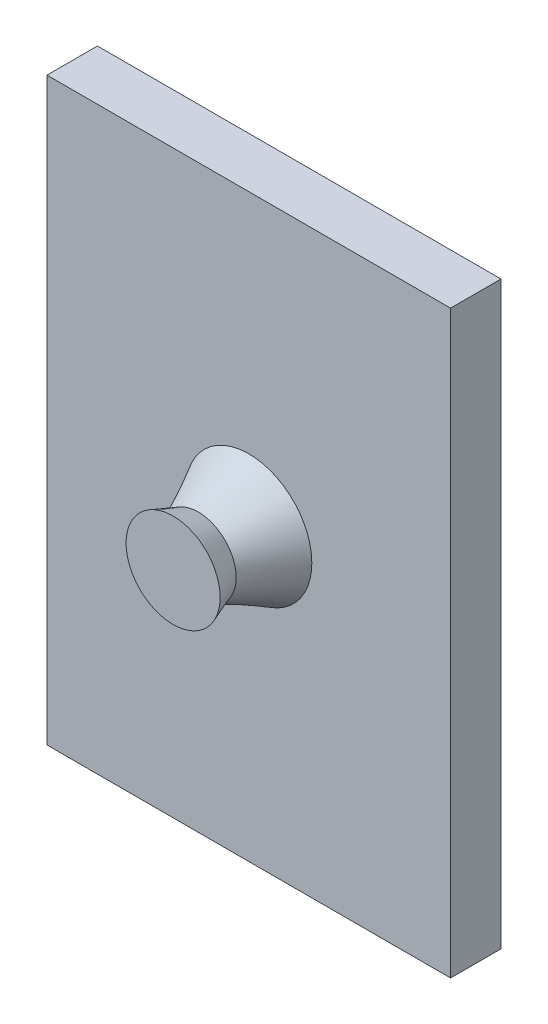
ISO-10303-21;
HEADER;
FILE_DESCRIPTION(('STEP AP214'),'2;1');
FILE_NAME('part.step','',(''),(''),'','','');
FILE_SCHEMA(('AUTOMOTIVE_DESIGN { 1 0 10303 214 1 1 1 1 }'));
ENDSEC;
DATA;
#1=APPLICATION_CONTEXT('core data for automotive mechanical design processes');
#2=APPLICATION_PROTOCOL_DEFINITION('international standard','automotive_design',2000,#1);
#3=PRODUCT_CONTEXT('',#1,'mechanical');
#4=PRODUCT('Part','Part','',(#3));
#5=PRODUCT_RELATED_PRODUCT_CATEGORY('part','',(#4));
#6=PRODUCT_DEFINITION_FORMATION('','',#4);
#7=PRODUCT_DEFINITION_CONTEXT('part definition',#1,'design');
#8=PRODUCT_DEFINITION('design','',#6,#7);
#9=PRODUCT_DEFINITION_SHAPE('','',#8);
#10=(LENGTH_UNIT() NAMED_UNIT(*) SI_UNIT(.MILLI.,.METRE.));
#11=(NAMED_UNIT(*) PLANE_ANGLE_UNIT() SI_UNIT($,.RADIAN.));
#12=(NAMED_UNIT(*) SI_UNIT($,.STERADIAN.) SOLID_ANGLE_UNIT());
#13=UNCERTAINTY_MEASURE_WITH_UNIT(LENGTH_MEASURE(1.E-05),#10,'distance_accuracy_value','');
#14=(GEOMETRIC_REPRESENTATION_CONTEXT(3) GLOBAL_UNCERTAINTY_ASSIGNED_CONTEXT((#13)) GLOBAL_UNIT_ASSIGNED_CONTEXT((#10,
#11,#12)) REPRESENTATION_CONTEXT('',''));
#15=CARTESIAN_POINT('',(0.,0.,0.));
#16=DIRECTION('',(0.,0.,1.));
#17=DIRECTION('',(1.,0.,0.));
#18=AXIS2_PLACEMENT_3D('',#15,#16,#17);
#19=CARTESIAN_POINT('',(0.,0.,2.));
#20=DIRECTION('',(1.,0.,0.));
#21=DIRECTION('',(0.,0.,-1.));
#22=AXIS2_PLACEMENT_3D('',#19,#20,#21);
#23=PLANE('',#22);
#24=DIRECTION('',(0.,-1.,0.));
#25=VECTOR('',#24,1.);
#26=CARTESIAN_POINT('',(0.,0.,0.));
#27=LINE('',#26,#25);
#28=CARTESIAN_POINT('',(0.,23.,0.));
#29=VERTEX_POINT('',#28);
#30=CARTESIAN_POINT('',(0.,0.,0.));
#31=VERTEX_POINT('',#30);
#32=EDGE_CURVE('E119',#29,#31,#27,.T.);
#33=ORIENTED_EDGE('',*,*,#32,.T.);
#34=DIRECTION('',(0.,0.,-1.));
#35=VECTOR('',#34,1.);
#36=CARTESIAN_POINT('',(0.,0.,2.));
#37=LINE('',#36,#35);
#38=CARTESIAN_POINT('',(0.,0.,2.));
#39=VERTEX_POINT('',#38);
#40=EDGE_CURVE('E12',#39,#31,#37,.T.);
#41=ORIENTED_EDGE('',*,*,#40,.F.);
#42=DIRECTION('',(0.,-1.,0.));
#43=VECTOR('',#42,1.);
#44=CARTESIAN_POINT('',(0.,0.,2.));
#45=LINE('',#44,#43);
#46=CARTESIAN_POINT('',(0.,23.,2.));
#47=VERTEX_POINT('',#46);
#48=EDGE_CURVE('E102',#47,#39,#45,.T.);
#49=ORIENTED_EDGE('',*,*,#48,.F.);
#50=DIRECTION('',(0.,0.,-1.));
#51=VECTOR('',#50,1.);
#52=CARTESIAN_POINT('',(0.,23.,2.));
#53=LINE('',#52,#51);
#54=EDGE_CURVE('E115',#47,#29,#53,.T.);
#55=ORIENTED_EDGE('',*,*,#54,.T.);
#56=EDGE_LOOP('',(#33,#41,#49,#55));
#57=FACE_BOUND('',#56,.T.);
#58=ADVANCED_FACE('F47',(#57),#23,.F.);
#59=CARTESIAN_POINT('',(0.,0.,2.));
#60=DIRECTION('',(0.,1.,0.));
#61=DIRECTION('',(0.,0.,1.));
#62=AXIS2_PLACEMENT_3D('',#59,#60,#61);
#63=PLANE('',#62);
#64=DIRECTION('',(1.,0.,0.));
#65=VECTOR('',#64,1.);
#66=CARTESIAN_POINT('',(0.,0.,0.));
#67=LINE('',#66,#65);
#68=CARTESIAN_POINT('',(16.,0.,0.));
#69=VERTEX_POINT('',#68);
#70=EDGE_CURVE('E107',#31,#69,#67,.T.);
#71=ORIENTED_EDGE('',*,*,#70,.T.);
#72=DIRECTION('',(0.,0.,-1.));
#73=VECTOR('',#72,1.);
#74=CARTESIAN_POINT('',(16.,0.,2.));
#75=LINE('',#74,#73);
#76=CARTESIAN_POINT('',(16.,0.,2.));
#77=VERTEX_POINT('',#76);
#78=EDGE_CURVE('E58',#77,#69,#75,.T.);
#79=ORIENTED_EDGE('',*,*,#78,.F.);
#80=DIRECTION('',(1.,0.,0.));
#81=VECTOR('',#80,1.);
#82=CARTESIAN_POINT('',(0.,0.,2.));
#83=LINE('',#82,#81);
#84=EDGE_CURVE('E97',#39,#77,#83,.T.);
#85=ORIENTED_EDGE('',*,*,#84,.F.);
#86=ORIENTED_EDGE('',*,*,#40,.T.);
#87=EDGE_LOOP('',(#71,#79,#85,#86));
#88=FACE_BOUND('',#87,.T.);
#89=ADVANCED_FACE('F106',(#88),#63,.F.);
#90=CARTESIAN_POINT('',(16.,0.,2.));
#91=DIRECTION('',(-1.,0.,0.));
#92=DIRECTION('',(0.,0.,1.));
#93=AXIS2_PLACEMENT_3D('',#90,#91,#92);
#94=PLANE('',#93);
#95=DIRECTION('',(0.,1.,0.));
#96=VECTOR('',#95,1.);
#97=CARTESIAN_POINT('',(16.,0.,0.));
#98=LINE('',#97,#96);
#99=CARTESIAN_POINT('',(16.,23.,0.));
#100=VERTEX_POINT('',#99);
#101=EDGE_CURVE('E84',#69,#100,#98,.T.);
#102=ORIENTED_EDGE('',*,*,#101,.T.);
#103=DIRECTION('',(0.,0.,-1.));
#104=VECTOR('',#103,1.);
#105=CARTESIAN_POINT('',(16.,23.,2.));
#106=LINE('',#105,#104);
#107=CARTESIAN_POINT('',(16.,23.,2.));
#108=VERTEX_POINT('',#107);
#109=EDGE_CURVE('E109',#108,#100,#106,.T.);
#110=ORIENTED_EDGE('',*,*,#109,.F.);
#111=DIRECTION('',(0.,1.,0.));
#112=VECTOR('',#111,1.);
#113=CARTESIAN_POINT('',(16.,0.,2.));
#114=LINE('',#113,#112);
#115=EDGE_CURVE('E100',#77,#108,#114,.T.);
#116=ORIENTED_EDGE('',*,*,#115,.F.);
#117=ORIENTED_EDGE('',*,*,#78,.T.);
#118=EDGE_LOOP('',(#102,#110,#116,#117));
#119=FACE_BOUND('',#118,.T.);
#120=ADVANCED_FACE('F111',(#119),#94,.F.);
#121=CARTESIAN_POINT('',(0.,23.,2.));
#122=DIRECTION('',(0.,-1.,0.));
#123=DIRECTION('',(0.,0.,-1.));
#124=AXIS2_PLACEMENT_3D('',#121,#122,#123);
#125=PLANE('',#124);
#126=DIRECTION('',(-1.,0.,0.));
#127=VECTOR('',#126,1.);
#128=CARTESIAN_POINT('',(0.,23.,0.));
#129=LINE('',#128,#127);
#130=EDGE_CURVE('E90',#100,#29,#129,.T.);
#131=ORIENTED_EDGE('',*,*,#130,.T.);
#132=ORIENTED_EDGE('',*,*,#54,.F.);
#133=DIRECTION('',(-1.,0.,0.));
#134=VECTOR('',#133,1.);
#135=CARTESIAN_POINT('',(0.,23.,2.));
#136=LINE('',#135,#134);
#137=EDGE_CURVE('E67',#108,#47,#136,.T.);
#138=ORIENTED_EDGE('',*,*,#137,.F.);
#139=ORIENTED_EDGE('',*,*,#109,.T.);
#140=EDGE_LOOP('',(#131,#132,#138,#139));
#141=FACE_BOUND('',#140,.T.);
#142=ADVANCED_FACE('F201',(#141),#125,.F.);
#143=CARTESIAN_POINT('',(0.,0.,2.));
#144=DIRECTION('',(0.,0.,-1.));
#145=DIRECTION('',(-1.,0.,0.));
#146=AXIS2_PLACEMENT_3D('',#143,#144,#145);
#147=PLANE('',#146);
#148=CARTESIAN_POINT('',(8.,11.5,2.));
#149=DIRECTION('',(0.,0.,1.));
#150=DIRECTION('',(1.,0.,0.));
#151=AXIS2_PLACEMENT_3D('',#148,#149,#150);
#152=CIRCLE('',#151,2.5);
#153=CARTESIAN_POINT('',(10.5,11.5,2.));
#154=VERTEX_POINT('',#153);
#155=EDGE_CURVE('E171',#154,#154,#152,.T.);
#156=ORIENTED_EDGE('',*,*,#155,.F.);
#157=EDGE_LOOP('',(#156));
#158=FACE_BOUND('',#157,.T.);
#159=ORIENTED_EDGE('',*,*,#48,.T.);
#160=ORIENTED_EDGE('',*,*,#84,.T.);
#161=ORIENTED_EDGE('',*,*,#115,.T.);
#162=ORIENTED_EDGE('',*,*,#137,.T.);
#163=EDGE_LOOP('',(#159,#160,#161,#162));
#164=FACE_BOUND('',#163,.T.);
#165=ADVANCED_FACE('F98',(#158,#164),#147,.F.);
#166=CARTESIAN_POINT('',(0.,0.,0.));
#167=DIRECTION('',(0.,0.,-1.));
#168=DIRECTION('',(-1.,0.,0.));
#169=AXIS2_PLACEMENT_3D('',#166,#167,#168);
#170=PLANE('',#169);
#171=ORIENTED_EDGE('',*,*,#32,.F.);
#172=ORIENTED_EDGE('',*,*,#130,.F.);
#173=ORIENTED_EDGE('',*,*,#101,.F.);
#174=ORIENTED_EDGE('',*,*,#70,.F.);
#175=EDGE_LOOP('',(#171,#172,#173,#174));
#176=FACE_BOUND('',#175,.T.);
#177=ADVANCED_FACE('F157',(#176),#170,.T.);
#178=CARTESIAN_POINT('',(10.5,11.5,2.));
#179=CARTESIAN_POINT('',(9.38218526123225,10.9172788800529,4.));
#180=CARTESIAN_POINT('',(10.5,16.5,2.));
#181=CARTESIAN_POINT('',(10.5476275011263,13.6816494025174,4.));
#182=CARTESIAN_POINT('',(5.5,16.5,2.));
#183=CARTESIAN_POINT('',(7.78325697866185,14.8470916424115,4.));
#184=CARTESIAN_POINT('',(5.5,11.5,2.));
#185=CARTESIAN_POINT('',(6.61781473876775,12.0827211199471,4.));
#186=CARTESIAN_POINT('',(5.5,6.5,2.));
#187=CARTESIAN_POINT('',(5.45237249887365,9.31835059748255,4.));
#188=CARTESIAN_POINT('',(10.5,6.5,2.));
#189=CARTESIAN_POINT('',(8.21674302133815,8.15290835758845,4.));
#190=CARTESIAN_POINT('',(10.5,11.5,2.));
#191=CARTESIAN_POINT('',(9.38218526123225,10.9172788800529,4.));
#192=(BOUNDED_SURFACE() B_SPLINE_SURFACE(3,1,((#178,#179),(#180,#181),(#182,#183),(#184,#185),
(#186,#187),(#188,#189),(#190,#191)),.UNSPECIFIED.,.T.,.F.,.F.) B_SPLINE_SURFACE_WITH_KNOTS((4,
3,4),(2,2),(0.,0.5,1.),(0.,1.),
.UNSPECIFIED.) GEOMETRIC_REPRESENTATION_ITEM() RATIONAL_B_SPLINE_SURFACE(((1.,1.),
(0.333333333333333,0.333333333333333),(0.333333333333333,0.333333333333333),(1.,1.),
(0.333333333333333,0.333333333333333),(0.333333333333333,0.333333333333333),(1.,1.))) REPRESENTATION_ITEM('') SURFACE());
#193=CARTESIAN_POINT('',(8.,11.5,4.));
#194=DIRECTION('',(0.,0.,1.));
#195=DIRECTION('',(1.,0.,0.));
#196=AXIS2_PLACEMENT_3D('',#193,#194,#195);
#197=CIRCLE('',#196,1.5);
#198=CARTESIAN_POINT('',(9.38218526123225,10.9172788800529,4.));
#199=VERTEX_POINT('',#198);
#200=EDGE_CURVE('E50',#199,#199,#197,.T.);
#201=CARTESIAN_POINT('',(10.5,11.5,2.));
#202=CARTESIAN_POINT('',(10.4883560964712,11.4939299883339,2.02083333333333));
#203=CARTESIAN_POINT('',(10.4767121929423,11.4878599766678,2.04166666666667));
#204=CARTESIAN_POINT('',(10.4534243858847,11.4757199533355,2.08333333333333));
#205=CARTESIAN_POINT('',(10.4417804823558,11.4696499416694,2.10416666666667));
#206=CARTESIAN_POINT('',(10.4184926752982,11.4575099183372,2.14583333333333));
#207=CARTESIAN_POINT('',(10.4068487717694,11.4514399066711,2.16666666666667));
#208=CARTESIAN_POINT('',(10.3835609647117,11.4392998833388,2.20833333333333));
#209=CARTESIAN_POINT('',(10.3719170611829,11.4332298716727,2.22916666666667));
#210=CARTESIAN_POINT('',(10.3486292541252,11.4210898483405,2.27083333333333));
#211=CARTESIAN_POINT('',(10.3369853505964,11.4150198366744,2.29166666666667));
#212=CARTESIAN_POINT('',(10.3136975435387,11.4028798133422,2.33333333333333));
#213=CARTESIAN_POINT('',(10.3020536400099,11.396809801676,2.35416666666667));
#214=CARTESIAN_POINT('',(10.2787658329522,11.3846697783438,2.39583333333333));
#215=CARTESIAN_POINT('',(10.2671219294234,11.3785997666777,2.41666666666667));
#216=CARTESIAN_POINT('',(10.2438341223657,11.3664597433455,2.45833333333333));
#217=CARTESIAN_POINT('',(10.2321902188369,11.3603897316794,2.47916666666667));
#218=CARTESIAN_POINT('',(10.2089024117792,11.3482497083471,2.52083333333333));
#219=CARTESIAN_POINT('',(10.1972585082504,11.342179696681,2.54166666666667));
#220=CARTESIAN_POINT('',(10.1739707011927,11.3300396733488,2.58333333333333));
#221=CARTESIAN_POINT('',(10.1623267976639,11.3239696616827,2.60416666666667));
#222=CARTESIAN_POINT('',(10.1390389906062,11.3118296383504,2.64583333333333));
#223=CARTESIAN_POINT('',(10.1273950870774,11.3057596266843,2.66666666666667));
#224=CARTESIAN_POINT('',(10.1041072800198,11.2936196033521,2.70833333333333));
#225=CARTESIAN_POINT('',(10.0924633764909,11.287549591686,2.72916666666667));
#226=CARTESIAN_POINT('',(10.0691755694333,11.2754095683537,2.77083333333333));
#227=CARTESIAN_POINT('',(10.0575316659044,11.2693395566876,2.79166666666667));
#228=CARTESIAN_POINT('',(10.0342438588468,11.2571995333554,2.83333333333333));
#229=CARTESIAN_POINT('',(10.0225999553179,11.2511295216893,2.85416666666667));
#230=CARTESIAN_POINT('',(9.99931214826028,11.238989498357,2.89583333333333));
#231=CARTESIAN_POINT('',(9.98766824473145,11.2329194866909,2.91666666666667));
#232=CARTESIAN_POINT('',(9.96438043767379,11.2207794633587,2.95833333333333));
#233=CARTESIAN_POINT('',(9.95273653414495,11.2147094516926,2.97916666666667));
#234=CARTESIAN_POINT('',(9.92944872708729,11.2025694283604,3.02083333333333));
#235=CARTESIAN_POINT('',(9.91780482355846,11.1964994166942,3.04166666666667));
#236=CARTESIAN_POINT('',(9.8945170165008,11.184359393362,3.08333333333333));
#237=CARTESIAN_POINT('',(9.88287311297197,11.1782893816959,3.10416666666667));
#238=CARTESIAN_POINT('',(9.85958530591431,11.1661493583637,3.14583333333333));
#239=CARTESIAN_POINT('',(9.84794140238548,11.1600793466976,3.16666666666667));
#240=CARTESIAN_POINT('',(9.82465359532782,11.1479393233653,3.20833333333333));
#241=CARTESIAN_POINT('',(9.81300969179899,11.1418693116992,3.22916666666667));
#242=CARTESIAN_POINT('',(9.78972188474133,11.129729288367,3.27083333333333));
#243=CARTESIAN_POINT('',(9.77807798121249,11.1236592767009,3.29166666666667));
#244=CARTESIAN_POINT('',(9.75479017415483,11.1115192533686,3.33333333333333));
#245=CARTESIAN_POINT('',(9.743146270626,11.1054492417025,3.35416666666667));
#246=CARTESIAN_POINT('',(9.71985846356834,11.0933092183703,3.39583333333333));
#247=CARTESIAN_POINT('',(9.70821456003951,11.0872392067042,3.41666666666667));
#248=CARTESIAN_POINT('',(9.68492675298185,11.0750991833719,3.45833333333333));
#249=CARTESIAN_POINT('',(9.67328284945302,11.0690291717058,3.47916666666667));
#250=CARTESIAN_POINT('',(9.64999504239536,11.0568891483736,3.52083333333333));
#251=CARTESIAN_POINT('',(9.63835113886653,11.0508191367075,3.54166666666667));
#252=CARTESIAN_POINT('',(9.61506333180887,11.0386791133753,3.58333333333333));
#253=CARTESIAN_POINT('',(9.60341942828003,11.0326091017091,3.60416666666667));
#254=CARTESIAN_POINT('',(9.58013162122237,11.0204690783769,3.64583333333333));
#255=CARTESIAN_POINT('',(9.56848771769354,11.0143990667108,3.66666666666667));
#256=CARTESIAN_POINT('',(9.54519991063588,11.0022590433786,3.70833333333333));
#257=CARTESIAN_POINT('',(9.53355600710705,10.9961890317124,3.72916666666667));
#258=CARTESIAN_POINT('',(9.51026820004939,10.9840490083802,3.77083333333333));
#259=CARTESIAN_POINT('',(9.49862429652056,10.9779789967141,3.79166666666667));
#260=CARTESIAN_POINT('',(9.4753364894629,10.9658389733819,3.83333333333333));
#261=CARTESIAN_POINT('',(9.46369258593406,10.9597689617158,3.85416666666667));
#262=CARTESIAN_POINT('',(9.4404047788764,10.9476289383835,3.89583333333333));
#263=CARTESIAN_POINT('',(9.42876087534757,10.9415589267174,3.91666666666667));
#264=CARTESIAN_POINT('',(9.40547306828991,10.9294189033852,3.95833333333333));
#265=CARTESIAN_POINT('',(9.39382916476108,10.9233488917191,3.97916666666667));
#266=CARTESIAN_POINT('',(9.38218526123225,10.9172788800529,4.));
#267=B_SPLINE_CURVE_WITH_KNOTS('',3,(#201,#202,#203,#204,#205,#206,#207,#208,#209,#210,#211,
#212,#213,#214,#215,#216,#217,#218,#219,#220,#221,#222,#223,#224,#225,#226,#227,#228,#229,#230,
#231,#232,#233,#234,#235,#236,#237,#238,#239,#240,#241,#242,#243,#244,#245,#246,#247,#248,#249,
#250,#251,#252,#253,#254,#255,#256,#257,#258,#259,#260,#261,#262,#263,#264,#265,#266),
.UNSPECIFIED.,.F.,.F.,(4,2,2,2,2,2,2,2,2,2,2,2,2,2,2,2,2,2,2,2,2,2,2,2,2,2,2,2,2,2,2,2,4),(0.,
0.0738788182034571,0.147757636406914,0.221636454610371,0.295515272813827,0.369394091017284,
0.443272909220741,0.517151727424197,0.591030545627655,0.664909363831111,0.738788182034568,
0.812667000238025,0.886545818441481,0.960424636644938,1.0343034548484,1.10818227305185,
1.18206109125531,1.25593990945877,1.32981872766222,1.40369754586568,1.47757636406914,
1.55145518227259,1.62533400047605,1.69921281867951,1.77309163688296,1.84697045508642,
1.92084927328988,1.99472809149333,2.06860690969679,2.14248572790025,2.2163645461037,
2.29024336430716,2.36412218251062),.UNSPECIFIED.);
#268=EDGE_CURVE('BSEAM150',#154,#199,#267,.T.);
#269=ORIENTED_EDGE('',*,*,#155,.T.);
#270=ORIENTED_EDGE('',*,*,#200,.F.);
#271=ORIENTED_EDGE('',*,*,#268,.T.);
#272=ORIENTED_EDGE('',*,*,#268,.F.);
#273=EDGE_LOOP('',(#269,#271,#270,#272));
#274=FACE_BOUND('',#273,.T.);
#275=ADVANCED_FACE('F150',(#274),#192,.T.);
#276=CARTESIAN_POINT('',(8.,11.5,4.));
#277=DIRECTION('',(0.,0.,1.));
#278=DIRECTION('',(1.,0.,0.));
#279=AXIS2_PLACEMENT_3D('',#276,#277,#278);
#280=CONICAL_SURFACE('',#279,1.5,0.349065850398867);
#281=CARTESIAN_POINT('',(8.,11.5,5.));
#282=DIRECTION('',(0.,0.,1.));
#283=DIRECTION('',(1.,0.,0.));
#284=AXIS2_PLACEMENT_3D('',#281,#282,#283);
#285=CIRCLE('',#284,1.8639702342662);
#286=CARTESIAN_POINT('',(9.8639702342662,11.5,5.));
#287=VERTEX_POINT('',#286);
#288=EDGE_CURVE('E179',#287,#287,#285,.T.);
#289=ORIENTED_EDGE('',*,*,#288,.F.);
#290=EDGE_LOOP('',(#289));
#291=FACE_BOUND('',#290,.T.);
#292=ORIENTED_EDGE('',*,*,#200,.T.);
#293=EDGE_LOOP('',(#292));
#294=FACE_BOUND('',#293,.T.);
#295=ADVANCED_FACE('F139',(#291,#294),#280,.T.);
#296=CARTESIAN_POINT('',(8.,11.5,5.));
#297=DIRECTION('',(0.,0.,1.));
#298=DIRECTION('',(1.,0.,0.));
#299=AXIS2_PLACEMENT_3D('',#296,#297,#298);
#300=PLANE('',#299);
#301=ORIENTED_EDGE('',*,*,#288,.T.);
#302=EDGE_LOOP('',(#301));
#303=FACE_BOUND('',#302,.T.);
#304=ADVANCED_FACE('F149',(#303),#300,.T.);
#305=CLOSED_SHELL('',(#58,#89,#120,#142,#165,#177,#275,#295,#304));
#306=MANIFOLD_SOLID_BREP('B2',#305);
#307=ADVANCED_BREP_SHAPE_REPRESENTATION('',(#18,#306),#14);
#308=SHAPE_DEFINITION_REPRESENTATION(#9,#307);
ENDSEC;
END-ISO-10303-21;
